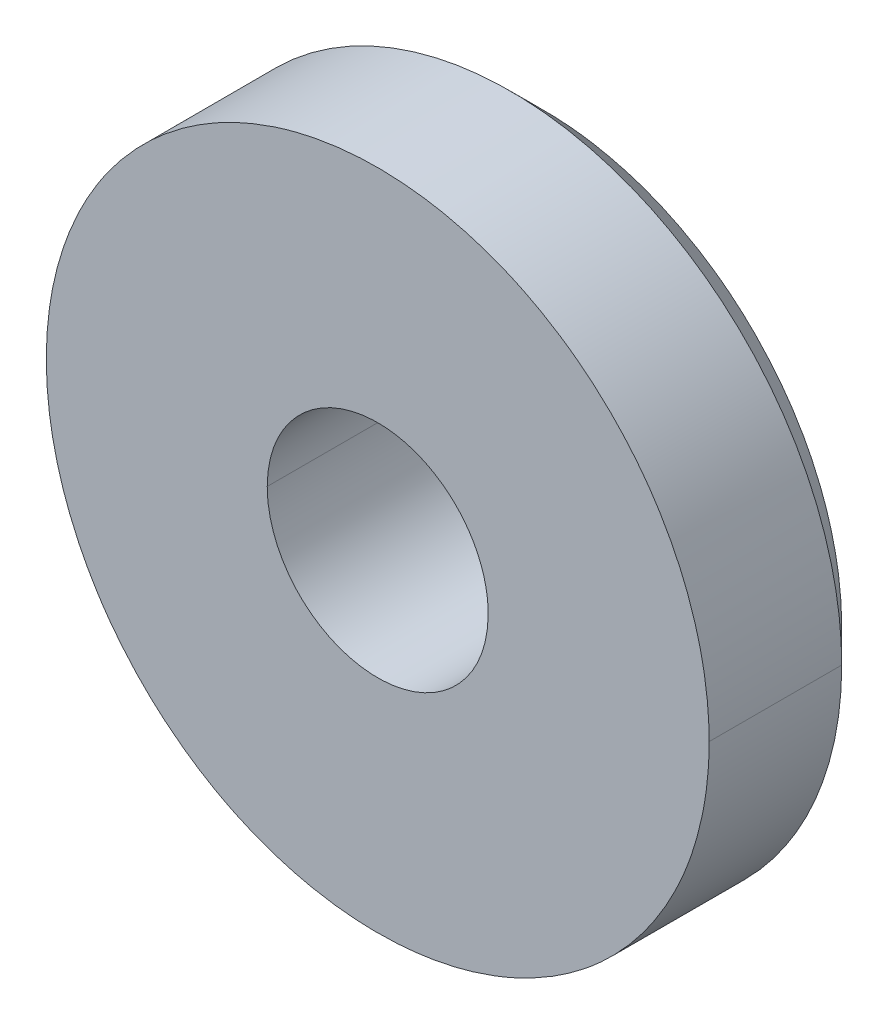
ISO-10303-21;
HEADER;
FILE_DESCRIPTION(('STEP AP214'),'2;1');
FILE_NAME('part.step','',(''),(''),'','','');
FILE_SCHEMA(('AUTOMOTIVE_DESIGN { 1 0 10303 214 1 1 1 1 }'));
ENDSEC;
DATA;
#1=APPLICATION_CONTEXT('core data for automotive mechanical design processes');
#2=APPLICATION_PROTOCOL_DEFINITION('international standard','automotive_design',2000,#1);
#3=PRODUCT_CONTEXT('',#1,'mechanical');
#4=PRODUCT('Part','Part','',(#3));
#5=PRODUCT_RELATED_PRODUCT_CATEGORY('part','',(#4));
#6=PRODUCT_DEFINITION_FORMATION('','',#4);
#7=PRODUCT_DEFINITION_CONTEXT('part definition',#1,'design');
#8=PRODUCT_DEFINITION('design','',#6,#7);
#9=PRODUCT_DEFINITION_SHAPE('','',#8);
#10=(LENGTH_UNIT() NAMED_UNIT(*) SI_UNIT(.MILLI.,.METRE.));
#11=(NAMED_UNIT(*) PLANE_ANGLE_UNIT() SI_UNIT($,.RADIAN.));
#12=(NAMED_UNIT(*) SI_UNIT($,.STERADIAN.) SOLID_ANGLE_UNIT());
#13=UNCERTAINTY_MEASURE_WITH_UNIT(LENGTH_MEASURE(1.E-05),#10,'distance_accuracy_value','');
#14=(GEOMETRIC_REPRESENTATION_CONTEXT(3) GLOBAL_UNCERTAINTY_ASSIGNED_CONTEXT((#13)) GLOBAL_UNIT_ASSIGNED_CONTEXT((#10,
#11,#12)) REPRESENTATION_CONTEXT('',''));
#15=CARTESIAN_POINT('',(0.,0.,0.));
#16=DIRECTION('',(0.,0.,1.));
#17=DIRECTION('',(1.,0.,0.));
#18=AXIS2_PLACEMENT_3D('',#15,#16,#17);
#19=CARTESIAN_POINT('',(-1.5946900874,-6.2154791283,3.85520000018));
#20=CARTESIAN_POINT('',(-1.5946900874,-6.2154791283,4.148));
#21=CARTESIAN_POINT('',(-1.5946900874,-5.98551454605,3.85520000018));
#22=CARTESIAN_POINT('',(-1.5946900874,-5.98551454605,4.148));
#23=CARTESIAN_POINT('',(-1.68473707036,-5.75533540536,3.85520000018));
#24=CARTESIAN_POINT('',(-1.68473707036,-5.75533540536,4.148));
#25=CARTESIAN_POINT('',(-1.86676092292,-5.57352611126,3.85520000018));
#26=CARTESIAN_POINT('',(-1.86676092292,-5.57352611126,4.148));
#27=CARTESIAN_POINT('',(-2.3266900874,-5.39343214534,3.85520000018));
#28=CARTESIAN_POINT('',(-2.3266900874,-5.39343214534,4.148));
#29=CARTESIAN_POINT('',(-2.78661925189,-5.57352611126,3.85520000018));
#30=CARTESIAN_POINT('',(-2.78661925189,-5.57352611126,4.148));
#31=CARTESIAN_POINT('',(-2.96864310444,-5.75533540536,3.85520000018));
#32=CARTESIAN_POINT('',(-2.96864310444,-5.75533540536,4.148));
#33=CARTESIAN_POINT('',(-3.0586900874,-5.98551454605,3.85520000018));
#34=CARTESIAN_POINT('',(-3.0586900874,-5.98551454605,4.148));
#35=CARTESIAN_POINT('',(-3.0586900874,-6.2154791283,3.85520000018));
#36=CARTESIAN_POINT('',(-3.0586900874,-6.2154791283,4.148));
#37=B_SPLINE_SURFACE_WITH_KNOTS('',5,1,((#19,#20),(#21,#22),(#23,#24),(#25,#26),(#27,#28),(#29,
#30),(#31,#32),(#33,#34),(#35,#36)),.UNSPECIFIED.,.F.,.F.,.F.,(6,3,6),(2,2),(0.,4.71238898038,
9.42477796077),(0.300000000745,1.5),.UNSPECIFIED.);
#38=DIRECTION('',(0.,0.,1.));
#39=VECTOR('',#38,1.);
#40=CARTESIAN_POINT('',(-3.0586900874,-6.2154791283,4.00160000009));
#41=LINE('',#40,#39);
#42=CARTESIAN_POINT('',(-3.0586900874,-6.2154791283,3.855200000045));
#43=VERTEX_POINT('',#42);
#44=CARTESIAN_POINT('',(-3.0586900874,-6.2154791283,4.148));
#45=VERTEX_POINT('',#44);
#46=EDGE_CURVE('E76',#43,#45,#41,.T.);
#47=CARTESIAN_POINT('',(-3.0586900874,-6.2154791283,4.148));
#48=CARTESIAN_POINT('',(-3.0587297130482,-6.17428402824898,4.148));
#49=CARTESIAN_POINT('',(-3.05522469420443,-6.13309724122196,4.148));
#50=CARTESIAN_POINT('',(-3.04137697436363,-6.05192396198568,4.148));
#51=CARTESIAN_POINT('',(-3.03104002627669,-6.01193648946896,4.148));
#52=CARTESIAN_POINT('',(-3.00378288511302,-5.93428259626322,4.148));
#53=CARTESIAN_POINT('',(-2.98686442898609,-5.89661556621344,4.148));
#54=CARTESIAN_POINT('',(-2.94695185028575,-5.82466314072065,4.148));
#55=CARTESIAN_POINT('',(-2.92395896373443,-5.79037705927075,4.148));
#56=CARTESIAN_POINT('',(-2.87254543566545,-5.72613212158392,4.148));
#57=CARTESIAN_POINT('',(-2.84412306936096,-5.69617464574419,4.148));
#58=CARTESIAN_POINT('',(-2.7826607481463,-5.64144521526489,4.148));
#59=CARTESIAN_POINT('',(-2.74962087442223,-5.61667316947299,4.148));
#60=CARTESIAN_POINT('',(-2.67977354823956,-5.57297011727616,4.148));
#61=CARTESIAN_POINT('',(-2.64295731047137,-5.55405316214536,4.148));
#62=CARTESIAN_POINT('',(-2.56669403809196,-5.52270871771052,4.148));
#63=CARTESIAN_POINT('',(-2.52725011221892,-5.51027370834599,4.148));
#64=CARTESIAN_POINT('',(-2.46030328340995,-5.49523878720352,4.148));
#65=CARTESIAN_POINT('',(-2.43321122260478,-5.49074126558087,4.148));
#66=CARTESIAN_POINT('',(-2.37869259937164,-5.48481005492516,4.148));
#67=CARTESIAN_POINT('',(-2.35126601793214,-5.48337654085006,4.148));
#68=CARTESIAN_POINT('',(-2.28270445413778,-5.48364682688609,4.148));
#69=CARTESIAN_POINT('',(-2.24156214459007,-5.48727440267562,4.148));
#70=CARTESIAN_POINT('',(-2.16044512212728,-5.50140051603713,4.148));
#71=CARTESIAN_POINT('',(-2.12047161014731,-5.5119058780797,4.148));
#72=CARTESIAN_POINT('',(-2.0429402455239,-5.53946418913209,4.148));
#73=CARTESIAN_POINT('',(-2.00537753931025,-5.55650346802521,4.148));
#74=CARTESIAN_POINT('',(-1.9335798662705,-5.59667217110095,4.148));
#75=CARTESIAN_POINT('',(-1.8993507259189,-5.61981200533305,4.148));
#76=CARTESIAN_POINT('',(-1.8352402249155,-5.67151574247714,4.148));
#77=CARTESIAN_POINT('',(-1.80536109566033,-5.70008241196175,4.148));
#78=CARTESIAN_POINT('',(-1.75086372717047,-5.7617708549217,4.148));
#79=CARTESIAN_POINT('',(-1.72623662010871,-5.79488479254579,4.148));
#80=CARTESIAN_POINT('',(-1.68282510812822,-5.8648637365777,4.148));
#81=CARTESIAN_POINT('',(-1.66405651560286,-5.90173854429671,4.148));
#82=CARTESIAN_POINT('',(-1.63300509841237,-5.97811720642323,4.148));
#83=CARTESIAN_POINT('',(-1.62071873375407,-6.0176196125785,4.148));
#84=CARTESIAN_POINT('',(-1.60614018691681,-6.08373114698219,4.148));
#85=CARTESIAN_POINT('',(-1.6018465809029,-6.10991628519223,4.148));
#86=CARTESIAN_POINT('',(-1.59612186005267,-6.16255718674684,4.148));
#87=CARTESIAN_POINT('',(-1.59468638557008,-6.18901247595829,4.148));
#88=CARTESIAN_POINT('',(-1.5946900874,-6.21547912811599,4.148));
#89=B_SPLINE_CURVE_WITH_KNOTS('',3,(#47,#48,#49,#50,#51,#52,#53,#54,#55,#56,#57,#58,#59,#60,#61,
#62,#63,#64,#65,#66,#67,#68,#69,#70,#71,#72,#73,#74,#75,#76,#77,#78,#79,#80,#81,#82,#83,#84,#85,
#86,#87,#88),.UNSPECIFIED.,.F.,.F.,(4,2,2,2,2,2,2,2,2,2,2,2,2,2,2,2,2,2,2,2,4),(0.,
0.123423883470309,0.246743968529999,0.370031529791894,0.493294023858346,0.616595740124948,
0.739895288744415,0.863488482338461,0.98693796776263,1.06916443342276,1.15139559417269,
1.27468367457197,1.39809427312452,1.5212480711825,1.64461339584236,1.76804178110369,
1.89126008296987,2.01480813698249,2.13828865045665,2.21774840992787,2.29708687244575),.UNSPECIFIED.);
#90=CARTESIAN_POINT('',(-1.5946900874,-6.215479128208,4.148));
#91=VERTEX_POINT('',#90);
#92=EDGE_CURVE('E24',#45,#91,#89,.T.);
#93=DIRECTION('',(0.,0.,-1.));
#94=VECTOR('',#93,1.);
#95=CARTESIAN_POINT('',(-1.5946900874,-6.2154791283,4.00160000009));
#96=LINE('',#95,#94);
#97=CARTESIAN_POINT('',(-1.5946900874,-6.2154791283,3.855200000045));
#98=VERTEX_POINT('',#97);
#99=EDGE_CURVE('E66',#91,#98,#96,.T.);
#100=CARTESIAN_POINT('',(-1.5946900874,-6.2154791283,3.8552));
#101=CARTESIAN_POINT('',(-1.5946900874,-5.98551454605,3.8552));
#102=CARTESIAN_POINT('',(-1.68473707036,-5.75533540536,3.8552));
#103=CARTESIAN_POINT('',(-1.86676092292,-5.57352611126,3.8552));
#104=CARTESIAN_POINT('',(-2.3266900874,-5.39343214534,3.8552));
#105=CARTESIAN_POINT('',(-2.78661925189,-5.57352611126,3.8552));
#106=CARTESIAN_POINT('',(-2.96864310444,-5.75533540536,3.8552));
#107=CARTESIAN_POINT('',(-3.0586900874,-5.98551454605,3.8552));
#108=CARTESIAN_POINT('',(-3.0586900874,-6.2154791283,3.8552));
#109=B_SPLINE_CURVE_WITH_KNOTS('',5,(#100,#101,#102,#103,#104,#105,#106,#107,#108),
.UNSPECIFIED.,.F.,.F.,(6,3,6),(0.,157.079632679,314.159265359),.UNSPECIFIED.);
#110=EDGE_CURVE('E75',#43,#98,#109,.F.);
#111=ORIENTED_EDGE('',*,*,#46,.T.);
#112=ORIENTED_EDGE('',*,*,#92,.T.);
#113=ORIENTED_EDGE('',*,*,#99,.T.);
#114=ORIENTED_EDGE('',*,*,#110,.F.);
#115=EDGE_LOOP('',(#111,#112,#113,#114));
#116=FACE_BOUND('',#115,.T.);
#117=ADVANCED_FACE('F17',(#116),#37,.T.);
#118=CARTESIAN_POINT('',(-1.6678900874,-6.2154791283,3.782));
#119=CARTESIAN_POINT('',(-1.5946900874,-6.2154791283,3.8552));
#120=CARTESIAN_POINT('',(-1.6678900874,-6.00851100428,3.782));
#121=CARTESIAN_POINT('',(-1.5946900874,-5.98551454605,3.8552));
#122=CARTESIAN_POINT('',(-1.74893237207,-5.80134977765,3.782));
#123=CARTESIAN_POINT('',(-1.68473707036,-5.75533540536,3.8552));
#124=CARTESIAN_POINT('',(-1.91275383936,-5.63772141296,3.782));
#125=CARTESIAN_POINT('',(-1.86676092292,-5.57352611126,3.8552));
#126=CARTESIAN_POINT('',(-2.3266900874,-5.47563684363,3.782));
#127=CARTESIAN_POINT('',(-2.3266900874,-5.39343214534,3.8552));
#128=CARTESIAN_POINT('',(-2.74062633544,-5.63772141296,3.782));
#129=CARTESIAN_POINT('',(-2.78661925189,-5.57352611126,3.8552));
#130=CARTESIAN_POINT('',(-2.90444780274,-5.80134977765,3.782));
#131=CARTESIAN_POINT('',(-2.96864310444,-5.75533540536,3.8552));
#132=CARTESIAN_POINT('',(-2.9854900874,-6.00851100428,3.782));
#133=CARTESIAN_POINT('',(-3.0586900874,-5.98551454605,3.8552));
#134=CARTESIAN_POINT('',(-2.9854900874,-6.2154791283,3.782));
#135=CARTESIAN_POINT('',(-3.0586900874,-6.2154791283,3.8552));
#136=B_SPLINE_SURFACE_WITH_KNOTS('',5,1,((#118,#119),(#120,#121),(#122,#123),(#124,#125),(#126,
#127),(#128,#129),(#130,#131),(#132,#133),(#134,#135)),.UNSPECIFIED.,.F.,.F.,.F.,(6,3,6),(2,2),
(0.,157.079632679,314.159265359),(-0.212132034356,0.212132034356),.UNSPECIFIED.);
#137=DIRECTION('',(0.707106781186548,0.,0.707106781186548));
#138=VECTOR('',#137,1.);
#139=CARTESIAN_POINT('',(-1.6312900874,-6.2154791283,3.8186));
#140=LINE('',#139,#138);
#141=CARTESIAN_POINT('',(-1.6678900874,-6.2154791283,3.782));
#142=VERTEX_POINT('',#141);
#143=EDGE_CURVE('E238',#142,#98,#140,.T.);
#144=CARTESIAN_POINT('',(-1.6678900874,-6.2154791283,3.782));
#145=CARTESIAN_POINT('',(-1.66785439953469,-6.17839165312669,3.782));
#146=CARTESIAN_POINT('',(-1.67101094459766,-6.14131171881073,3.782));
#147=CARTESIAN_POINT('',(-1.68348179010922,-6.06823330002169,3.782));
#148=CARTESIAN_POINT('',(-1.69279088073047,-6.03223392749363,3.782));
#149=CARTESIAN_POINT('',(-1.71734726974411,-5.96229834452599,3.782));
#150=CARTESIAN_POINT('',(-1.73259769562315,-5.92836323159651,3.782));
#151=CARTESIAN_POINT('',(-1.76857865398284,-5.86354340880975,3.782));
#152=CARTESIAN_POINT('',(-1.78930831263721,-5.83265821363046,3.782));
#153=CARTESIAN_POINT('',(-1.83563463124926,-5.77482805343801,3.782));
#154=CARTESIAN_POINT('',(-1.86122706279385,-5.74787970089898,3.782));
#155=CARTESIAN_POINT('',(-1.91656648928812,-5.6986497607574,3.782));
#156=CARTESIAN_POINT('',(-1.94631372800095,-5.67636844716259,3.782));
#157=CARTESIAN_POINT('',(-2.00918165227777,-5.63707618468034,3.782));
#158=CARTESIAN_POINT('',(-2.04230830399111,-5.62007477879474,3.782));
#159=CARTESIAN_POINT('',(-2.1109490499255,-5.59189260314835,3.782));
#160=CARTESIAN_POINT('',(-2.14646295197539,-5.58071136550214,3.782));
#161=CARTESIAN_POINT('',(-2.21877624128473,-5.56451278652949,3.782));
#162=CARTESIAN_POINT('',(-2.2555722314737,-5.5594802666227,3.782));
#163=CARTESIAN_POINT('',(-2.3294852744353,-5.55564652709677,3.782));
#164=CARTESIAN_POINT('',(-2.36660231388724,-5.55684505017121,3.782));
#165=CARTESIAN_POINT('',(-2.44016666175033,-5.56545733158197,3.782));
#166=CARTESIAN_POINT('',(-2.47661286933997,-5.5728805110866,3.782));
#167=CARTESIAN_POINT('',(-2.54773421917535,-5.59375527720736,3.782));
#168=CARTESIAN_POINT('',(-2.58240943987537,-5.60720659651995,3.782));
#169=CARTESIAN_POINT('',(-2.6489444182169,-5.63971494731152,3.782));
#170=CARTESIAN_POINT('',(-2.68080920883659,-5.65876168201099,3.782));
#171=CARTESIAN_POINT('',(-2.74089917327645,-5.70192189620624,3.782));
#172=CARTESIAN_POINT('',(-2.76912432942233,-5.72603540030508,3.782));
#173=CARTESIAN_POINT('',(-2.82120211999593,-5.77870654759098,3.782));
#174=CARTESIAN_POINT('',(-2.84504447854648,-5.80727435187043,3.782));
#175=CARTESIAN_POINT('',(-2.88759408400689,-5.86800768920819,3.782));
#176=CARTESIAN_POINT('',(-2.90630144776454,-5.90017314037792,3.782));
#177=CARTESIAN_POINT('',(-2.93805227174925,-5.96721278434888,3.782));
#178=CARTESIAN_POINT('',(-2.95109189643547,-6.0020887927142,3.782));
#179=CARTESIAN_POINT('',(-2.97108784512073,-6.07349522130386,3.782));
#180=CARTESIAN_POINT('',(-2.9780533982873,-6.11002304255177,3.782));
#181=CARTESIAN_POINT('',(-2.98430196070536,-6.16965663838581,3.782));
#182=CARTESIAN_POINT('',(-2.98550080822271,-6.19257430920654,3.782));
#183=CARTESIAN_POINT('',(-2.9854900874,-6.2154791283,3.782));
#184=B_SPLINE_CURVE_WITH_KNOTS('',3,(#144,#145,#146,#147,#148,#149,#150,#151,#152,#153,#154,
#155,#156,#157,#158,#159,#160,#161,#162,#163,#164,#165,#166,#167,#168,#169,#170,#171,#172,#173,
#174,#175,#176,#177,#178,#179,#180,#181,#182,#183),.UNSPECIFIED.,.F.,.F.,(4,2,2,2,2,2,2,2,2,2,2,
2,2,2,2,2,2,2,2,4),(0.,0.111116908842464,0.222139846908256,0.333221305983547,0.444285060501159,
0.555252678124525,0.666226808971294,0.777400364592113,0.888564981550005,0.999454622056889,
1.1103396834925,1.22139287571059,1.33244114402583,1.44328632599083,1.55413204620681,
1.66523442901891,1.7763342834655,1.88750920613075,1.99851490971071,2.0672313803994),.UNSPECIFIED.);
#185=CARTESIAN_POINT('',(-2.9854900874,-6.2154791283,3.782));
#186=VERTEX_POINT('',#185);
#187=EDGE_CURVE('E154',#142,#186,#184,.T.);
#188=DIRECTION('',(0.707106781186548,0.,-0.707106781186548));
#189=VECTOR('',#188,1.);
#190=CARTESIAN_POINT('',(-3.0220900874,-6.2154791283,3.8186));
#191=LINE('',#190,#189);
#192=EDGE_CURVE('E236',#43,#186,#191,.T.);
#193=ORIENTED_EDGE('',*,*,#143,.F.);
#194=ORIENTED_EDGE('',*,*,#187,.T.);
#195=ORIENTED_EDGE('',*,*,#192,.F.);
#196=ORIENTED_EDGE('',*,*,#110,.T.);
#197=EDGE_LOOP('',(#193,#194,#195,#196));
#198=FACE_BOUND('',#197,.T.);
#199=ADVANCED_FACE('F163',(#198),#136,.T.);
#200=CARTESIAN_POINT('',(-2.9854900874,-6.2154791283,3.782));
#201=CARTESIAN_POINT('',(-3.0586900874,-6.2154791283,3.8552));
#202=CARTESIAN_POINT('',(-2.9854900874,-6.42244725232,3.782));
#203=CARTESIAN_POINT('',(-3.0586900874,-6.44544371054,3.8552));
#204=CARTESIAN_POINT('',(-2.90444780274,-6.62960847894,3.782));
#205=CARTESIAN_POINT('',(-2.96864310444,-6.67562285124,3.8552));
#206=CARTESIAN_POINT('',(-2.74062633544,-6.79323684363,3.782));
#207=CARTESIAN_POINT('',(-2.78661925189,-6.85743214534,3.8552));
#208=CARTESIAN_POINT('',(-2.3266900874,-6.95532141296,3.782));
#209=CARTESIAN_POINT('',(-2.3266900874,-7.03752611126,3.8552));
#210=CARTESIAN_POINT('',(-1.91275383936,-6.79323684363,3.782));
#211=CARTESIAN_POINT('',(-1.86676092292,-6.85743214534,3.8552));
#212=CARTESIAN_POINT('',(-1.74893237207,-6.62960847894,3.782));
#213=CARTESIAN_POINT('',(-1.68473707036,-6.67562285124,3.8552));
#214=CARTESIAN_POINT('',(-1.6678900874,-6.42244725232,3.782));
#215=CARTESIAN_POINT('',(-1.5946900874,-6.44544371054,3.8552));
#216=CARTESIAN_POINT('',(-1.6678900874,-6.2154791283,3.782));
#217=CARTESIAN_POINT('',(-1.5946900874,-6.2154791283,3.8552));
#218=B_SPLINE_SURFACE_WITH_KNOTS('',5,1,((#200,#201),(#202,#203),(#204,#205),(#206,#207),(#208,
#209),(#210,#211),(#212,#213),(#214,#215),(#216,#217)),.UNSPECIFIED.,.F.,.F.,.F.,(6,3,6),(2,2),
(314.159265359,471.238898038,628.318530718),(-0.212132034358,0.212132034358),.UNSPECIFIED.);
#219=CARTESIAN_POINT('',(-2.9854900874,-6.2154791283,3.782));
#220=CARTESIAN_POINT('',(-2.98552577526541,-6.25256660347505,3.782));
#221=CARTESIAN_POINT('',(-2.98236923020243,-6.28964653779285,3.782));
#222=CARTESIAN_POINT('',(-2.9698983846902,-6.36272495658544,3.782));
#223=CARTESIAN_POINT('',(-2.96058929406828,-6.39872432911521,3.782));
#224=CARTESIAN_POINT('',(-2.93603290505224,-6.46865991208596,3.782));
#225=CARTESIAN_POINT('',(-2.92078247917143,-6.50259502501684,3.782));
#226=CARTESIAN_POINT('',(-2.88480152080738,-6.56741484780559,3.782));
#227=CARTESIAN_POINT('',(-2.8640718621504,-6.59830004298548,3.782));
#228=CARTESIAN_POINT('',(-2.81774554353548,-6.65613020317486,3.782));
#229=CARTESIAN_POINT('',(-2.79215311199118,-6.68307855571068,3.782));
#230=CARTESIAN_POINT('',(-2.73681368549832,-6.7323084958463,3.782));
#231=CARTESIAN_POINT('',(-2.70706644678659,-6.75458980943838,3.782));
#232=CARTESIAN_POINT('',(-2.64419852251058,-6.79388207191725,3.782));
#233=CARTESIAN_POINT('',(-2.6110718707967,-6.81088347780186,3.782));
#234=CARTESIAN_POINT('',(-2.54243112486149,-6.83906565344641,3.782));
#235=CARTESIAN_POINT('',(-2.50691722281131,-6.85024689109176,3.782));
#236=CARTESIAN_POINT('',(-2.43460393350043,-6.86644547006304,3.782));
#237=CARTESIAN_POINT('',(-2.39780794331015,-6.87147798996912,3.782));
#238=CARTESIAN_POINT('',(-2.32389490034609,-6.87531172949322,3.782));
#239=CARTESIAN_POINT('',(-2.286777860893,-6.87411320641766,3.782));
#240=CARTESIAN_POINT('',(-2.21321351302882,-6.8655009250044,3.782));
#241=CARTESIAN_POINT('',(-2.17676730543924,-6.85807774549854,3.782));
#242=CARTESIAN_POINT('',(-2.10564595560421,-6.83720297937526,3.782));
#243=CARTESIAN_POINT('',(-2.0709707349045,-6.82375166006139,3.782));
#244=CARTESIAN_POINT('',(-2.00443575656426,-6.79124330926746,3.782));
#245=CARTESIAN_POINT('',(-1.97257096594554,-6.77219657456699,3.782));
#246=CARTESIAN_POINT('',(-1.9124810015077,-6.72903636036998,3.782));
#247=CARTESIAN_POINT('',(-1.88425584536288,-6.70492285627038,3.782));
#248=CARTESIAN_POINT('',(-1.83217805479108,-6.65225170898294,3.782));
#249=CARTESIAN_POINT('',(-1.80833569624131,-6.62368390470265,3.782));
#250=CARTESIAN_POINT('',(-1.76578609078249,-6.56295056736343,3.782));
#251=CARTESIAN_POINT('',(-1.74707872702564,-6.53078511619308,3.782));
#252=CARTESIAN_POINT('',(-1.71532790304227,-6.46374547222039,3.782));
#253=CARTESIAN_POINT('',(-1.70228827835668,-6.42886946385391,3.782));
#254=CARTESIAN_POINT('',(-1.68229232967321,-6.35746303526202,3.782));
#255=CARTESIAN_POINT('',(-1.67532677650777,-6.32093521401304,3.782));
#256=CARTESIAN_POINT('',(-1.66907821409353,-6.26130161818998,3.782));
#257=CARTESIAN_POINT('',(-1.66787936657731,-6.23838394738136,3.782));
#258=CARTESIAN_POINT('',(-1.6678900874,-6.2154791283,3.782));
#259=B_SPLINE_CURVE_WITH_KNOTS('',3,(#219,#220,#221,#222,#223,#224,#225,#226,#227,#228,#229,
#230,#231,#232,#233,#234,#235,#236,#237,#238,#239,#240,#241,#242,#243,#244,#245,#246,#247,#248,
#249,#250,#251,#252,#253,#254,#255,#256,#257,#258),.UNSPECIFIED.,.F.,.F.,(4,2,2,2,2,2,2,2,2,2,2,
2,2,2,2,2,2,2,2,4),(0.,0.11111690884781,0.222139846918973,0.333221306000066,0.44428506052337,
0.55525267813924,0.666226808978553,0.77740036459947,0.888564981557445,0.999454622067872,
1.11033968350701,1.22139287572566,1.33244114404143,1.4432863260055,1.55413204622057,
1.66523442903309,1.77633428348011,1.88750920614792,1.99851490973026,2.06723138038268),.UNSPECIFIED.);
#260=EDGE_CURVE('E159',#186,#142,#259,.T.);
#261=CARTESIAN_POINT('',(-3.0586900874,-6.2154791283,3.8552));
#262=CARTESIAN_POINT('',(-3.0586900874,-6.44544371054,3.8552));
#263=CARTESIAN_POINT('',(-2.96864310444,-6.67562285124,3.8552));
#264=CARTESIAN_POINT('',(-2.78661925189,-6.85743214534,3.8552));
#265=CARTESIAN_POINT('',(-2.3266900874,-7.03752611126,3.8552));
#266=CARTESIAN_POINT('',(-1.86676092292,-6.85743214534,3.8552));
#267=CARTESIAN_POINT('',(-1.68473707036,-6.67562285124,3.8552));
#268=CARTESIAN_POINT('',(-1.5946900874,-6.44544371054,3.8552));
#269=CARTESIAN_POINT('',(-1.5946900874,-6.2154791283,3.8552));
#270=B_SPLINE_CURVE_WITH_KNOTS('',5,(#261,#262,#263,#264,#265,#266,#267,#268,#269),
.UNSPECIFIED.,.F.,.F.,(6,3,6),(9.42477796077,14.1371669412,18.8495559215),.UNSPECIFIED.);
#271=EDGE_CURVE('E153',#43,#98,#270,.T.);
#272=ORIENTED_EDGE('',*,*,#192,.T.);
#273=ORIENTED_EDGE('',*,*,#260,.T.);
#274=ORIENTED_EDGE('',*,*,#143,.T.);
#275=ORIENTED_EDGE('',*,*,#271,.F.);
#276=EDGE_LOOP('',(#272,#273,#274,#275));
#277=FACE_BOUND('',#276,.T.);
#278=ADVANCED_FACE('F126',(#277),#218,.T.);
#279=CARTESIAN_POINT('',(-2.3266900874,-6.2154791283,3.782));
#280=DIRECTION('',(0.,0.,1.));
#281=DIRECTION('',(1.,0.,0.));
#282=AXIS2_PLACEMENT_3D('',#279,#280,#281);
#283=PLANE('',#282);
#284=CARTESIAN_POINT('',(-2.5706900874,-6.2154791283,3.782));
#285=CARTESIAN_POINT('',(-2.5707021077229,-6.22919817813619,3.782));
#286=CARTESIAN_POINT('',(-2.56953662919008,-6.24291343735224,3.782));
#287=CARTESIAN_POINT('',(-2.56493080478152,-6.26994494809956,3.782));
#288=CARTESIAN_POINT('',(-2.56149238093263,-6.28326152682293,3.782));
#289=CARTESIAN_POINT('',(-2.55241817304435,-6.30913548549327,3.782));
#290=CARTESIAN_POINT('',(-2.54678123798789,-6.32169246377178,3.782));
#291=CARTESIAN_POINT('',(-2.53349571536123,-6.34567279795699,3.782));
#292=CARTESIAN_POINT('',(-2.52584743856073,-6.35709632861593,3.782));
#293=CARTESIAN_POINT('',(-2.50016966971488,-6.38917907396062,3.782));
#294=CARTESIAN_POINT('',(-2.47937704674538,-6.40773442523661,3.782));
#295=CARTESIAN_POINT('',(-2.43281991018911,-6.43690452787082,3.782));
#296=CARTESIAN_POINT('',(-2.40704669952372,-6.44750522838668,3.782));
#297=CARTESIAN_POINT('',(-2.35350135742393,-6.45955000682394,3.782));
#298=CARTESIAN_POINT('',(-2.32573438058671,-6.46101689384326,3.782));
#299=CARTESIAN_POINT('',(-2.27123832102816,-6.45467575430878,3.782));
#300=CARTESIAN_POINT('',(-2.24451078594693,-6.44685440623658,3.782));
#301=CARTESIAN_POINT('',(-2.19520928728014,-6.42283320017857,3.782));
#302=CARTESIAN_POINT('',(-2.17262788340661,-6.40664855340529,3.782));
#303=CARTESIAN_POINT('',(-2.13401238813075,-6.36763295796564,3.782));
#304=CARTESIAN_POINT('',(-2.11799334843978,-6.34478693348896,3.782));
#305=CARTESIAN_POINT('',(-2.10032739180873,-6.30761560926725,3.782));
#306=CARTESIAN_POINT('',(-2.09549575095424,-6.29471115934186,3.782));
#307=CARTESIAN_POINT('',(-2.08807367911316,-6.26827708572856,3.782));
#308=CARTESIAN_POINT('',(-2.08547986832616,-6.25474843744227,3.782));
#309=CARTESIAN_POINT('',(-2.08313668454035,-6.23259128521639,3.782));
#310=CARTESIAN_POINT('',(-2.0826846743972,-6.22403195798279,3.782));
#311=CARTESIAN_POINT('',(-2.0826900874,-6.2154791283,3.782));
#312=B_SPLINE_CURVE_WITH_KNOTS('',3,(#284,#285,#286,#287,#288,#289,#290,#291,#292,#293,#294,
#295,#296,#297,#298,#299,#300,#301,#302,#303,#304,#305,#306,#307,#308,#309,#310,#311),
.UNSPECIFIED.,.F.,.F.,(4,2,2,2,2,2,2,2,2,2,2,2,2,4),(0.,0.0411014434340057,0.0821681754324497,
0.123256436590269,0.164338352982463,0.246247380885569,0.328300751909617,0.410149135558562,
0.492115050995874,0.573932408388981,0.655936388731492,0.697112382822887,0.738226079293487,
0.763888788658428),.UNSPECIFIED.);
#313=CARTESIAN_POINT('',(-2.5706900874,-6.2154791283,3.782));
#314=VERTEX_POINT('',#313);
#315=CARTESIAN_POINT('',(-2.0826900874,-6.2154791283,3.782));
#316=VERTEX_POINT('',#315);
#317=EDGE_CURVE('E115',#314,#316,#312,.T.);
#318=ORIENTED_EDGE('',*,*,#317,.T.);
#319=CARTESIAN_POINT('',(-2.0826900874,-6.2154791283,3.782));
#320=CARTESIAN_POINT('',(-2.08267694111645,-6.20176084205352,3.782));
#321=CARTESIAN_POINT('',(-2.08384296827406,-6.18804532946043,3.782));
#322=CARTESIAN_POINT('',(-2.08844988939444,-6.16101313673476,3.782));
#323=CARTESIAN_POINT('',(-2.09188888968551,-6.14769613423882,3.782));
#324=CARTESIAN_POINT('',(-2.10096098764265,-6.1218231322955,3.782));
#325=CARTESIAN_POINT('',(-2.10659527435899,-6.10926754952819,3.782));
#326=CARTESIAN_POINT('',(-2.11988877152269,-6.08528252901385,3.782));
#327=CARTESIAN_POINT('',(-2.127547570369,-6.07385286300571,3.782));
#328=CARTESIAN_POINT('',(-2.14467578770429,-6.05243329763231,3.782));
#329=CARTESIAN_POINT('',(-2.15414603100901,-6.04244405779295,3.782));
#330=CARTESIAN_POINT('',(-2.1746259257622,-6.0241930806855,3.782));
#331=CARTESIAN_POINT('',(-2.18563560797713,-6.01593137795137,3.782));
#332=CARTESIAN_POINT('',(-2.20891450621805,-6.00135451166845,3.782));
#333=CARTESIAN_POINT('',(-2.22118666160575,-5.99504403431803,3.782));
#334=CARTESIAN_POINT('',(-2.24659758522142,-5.98458625888299,3.782));
#335=CARTESIAN_POINT('',(-2.25973529974465,-5.98043638342616,3.782));
#336=CARTESIAN_POINT('',(-2.29069080075316,-5.97347762606543,3.782));
#337=CARTESIAN_POINT('',(-2.30869906791842,-5.97148077429357,3.782));
#338=CARTESIAN_POINT('',(-2.3404016643382,-5.97147787382268,3.782));
#339=CARTESIAN_POINT('',(-2.3541032229762,-5.97263553267166,3.782));
#340=CARTESIAN_POINT('',(-2.38112682523739,-5.97722750259558,3.782));
#341=CARTESIAN_POINT('',(-2.39444846516928,-5.9806641476588,3.782));
#342=CARTESIAN_POINT('',(-2.43321725973362,-5.99427713062706,3.782));
#343=CARTESIAN_POINT('',(-2.45758486794942,-6.00775737220162,3.782));
#344=CARTESIAN_POINT('',(-2.50047412262921,-6.04205176351261,3.782));
#345=CARTESIAN_POINT('',(-2.5189927088417,-6.06286974039388,3.782));
#346=CARTESIAN_POINT('',(-2.54083177210876,-6.0977188028153,3.782));
#347=CARTESIAN_POINT('',(-2.54713052309718,-6.10997672592991,3.782));
#348=CARTESIAN_POINT('',(-2.55758144933437,-6.13538753554114,3.782));
#349=CARTESIAN_POINT('',(-2.56173473325166,-6.14853995582248,3.782));
#350=CARTESIAN_POINT('',(-2.56672530583682,-6.17072423545924,3.782));
#351=CARTESIAN_POINT('',(-2.56821187309918,-6.17961652535467,3.782));
#352=CARTESIAN_POINT('',(-2.57019398654303,-6.19749755500132,3.782));
#353=CARTESIAN_POINT('',(-2.57069099907835,-6.20648613216829,3.782));
#354=CARTESIAN_POINT('',(-2.5706900874,-6.2154791283,3.782));
#355=B_SPLINE_CURVE_WITH_KNOTS('',3,(#319,#320,#321,#322,#323,#324,#325,#326,#327,#328,#329,
#330,#331,#332,#333,#334,#335,#336,#337,#338,#339,#340,#341,#342,#343,#344,#345,#346,#347,#348,
#349,#350,#351,#352,#353,#354),.UNSPECIFIED.,.F.,.F.,(4,2,2,2,2,2,2,2,2,2,2,2,2,2,2,2,2,4),(0.,
0.0411011873926098,0.0821681754317654,0.123257437897714,0.164338352972977,0.205438018386299,
0.246538505315008,0.287736948773902,0.328886133539551,0.382765464936075,0.423828763132068,
0.464934180747948,0.546812467487794,0.628733522858245,0.669916143548082,0.711077461806767,
0.73807396306989,0.765030430191952),.UNSPECIFIED.);
#356=EDGE_CURVE('E147',#316,#314,#355,.T.);
#357=ORIENTED_EDGE('',*,*,#356,.T.);
#358=EDGE_LOOP('',(#318,#357));
#359=FACE_BOUND('',#358,.T.);
#360=ORIENTED_EDGE('',*,*,#260,.F.);
#361=ORIENTED_EDGE('',*,*,#187,.F.);
#362=EDGE_LOOP('',(#360,#361));
#363=FACE_BOUND('',#362,.T.);
#364=ADVANCED_FACE('F105',(#359,#363),#283,.F.);
#365=CARTESIAN_POINT('',(-3.0586900874,-6.2154791283,3.8552));
#366=CARTESIAN_POINT('',(-3.0586900874,-6.2154791283,4.148));
#367=CARTESIAN_POINT('',(-3.0586900874,-6.44544371054,3.8552));
#368=CARTESIAN_POINT('',(-3.0586900874,-6.44544371054,4.148));
#369=CARTESIAN_POINT('',(-2.96864310444,-6.67562285124,3.8552));
#370=CARTESIAN_POINT('',(-2.96864310444,-6.67562285124,4.148));
#371=CARTESIAN_POINT('',(-2.78661925189,-6.85743214534,3.8552));
#372=CARTESIAN_POINT('',(-2.78661925189,-6.85743214534,4.148));
#373=CARTESIAN_POINT('',(-2.3266900874,-7.03752611126,3.8552));
#374=CARTESIAN_POINT('',(-2.3266900874,-7.03752611126,4.148));
#375=CARTESIAN_POINT('',(-1.86676092292,-6.85743214534,3.8552));
#376=CARTESIAN_POINT('',(-1.86676092292,-6.85743214534,4.148));
#377=CARTESIAN_POINT('',(-1.68473707036,-6.67562285124,3.8552));
#378=CARTESIAN_POINT('',(-1.68473707036,-6.67562285124,4.148));
#379=CARTESIAN_POINT('',(-1.5946900874,-6.44544371054,3.8552));
#380=CARTESIAN_POINT('',(-1.5946900874,-6.44544371054,4.148));
#381=CARTESIAN_POINT('',(-1.5946900874,-6.2154791283,3.8552));
#382=CARTESIAN_POINT('',(-1.5946900874,-6.2154791283,4.148));
#383=B_SPLINE_SURFACE_WITH_KNOTS('',5,1,((#365,#366),(#367,#368),(#369,#370),(#371,#372),(#373,
#374),(#375,#376),(#377,#378),(#379,#380),(#381,#382)),.UNSPECIFIED.,.F.,.F.,.F.,(6,3,6),(2,2),
(9.42477796077,14.1371669412,18.8495559215),(0.3,1.5),.UNSPECIFIED.);
#384=CARTESIAN_POINT('',(-3.0586900874,-6.2154791283,4.148));
#385=CARTESIAN_POINT('',(-3.0587297086451,-6.25667446832543,4.148));
#386=CARTESIAN_POINT('',(-3.05522465106414,-6.29786149566738,4.148));
#387=CARTESIAN_POINT('',(-3.04137685624324,-6.37903476201844,4.148));
#388=CARTESIAN_POINT('',(-3.03103995145345,-6.41902199489569,4.148));
#389=CARTESIAN_POINT('',(-3.00378320073869,-6.49667474653684,4.148));
#390=CARTESIAN_POINT('',(-2.98686520808974,-6.5343409154709,4.148));
#391=CARTESIAN_POINT('',(-2.946952953147,-6.60629349780654,4.148));
#392=CARTESIAN_POINT('',(-2.92395964125458,-6.64058043869167,4.148));
#393=CARTESIAN_POINT('',(-2.87254636432963,-6.70482488658193,4.148));
#394=CARTESIAN_POINT('',(-2.84412501318658,-6.73478128429405,4.148));
#395=CARTESIAN_POINT('',(-2.7826636132686,-6.78951108566605,4.148));
#396=CARTESIAN_POINT('',(-2.74962328568669,-6.81428417622973,4.148));
#397=CARTESIAN_POINT('',(-2.67979140664495,-6.85797636653197,4.148));
#398=CARTESIAN_POINT('',(-2.64299320878682,-6.87688484678352,4.148));
#399=CARTESIAN_POINT('',(-2.56674096539612,-6.90823573339161,4.148));
#400=CARTESIAN_POINT('',(-2.527287135362,-6.92067866369988,4.148));
#401=CARTESIAN_POINT('',(-2.44694768686028,-6.93871644563332,4.148));
#402=CARTESIAN_POINT('',(-2.40606584717556,-6.94432814261456,4.148));
#403=CARTESIAN_POINT('',(-2.3239420483316,-6.94862791764507,4.148));
#404=CARTESIAN_POINT('',(-2.28270010405803,-6.9473162805447,4.148));
#405=CARTESIAN_POINT('',(-2.20095721874431,-6.93778691228294,4.148));
#406=CARTESIAN_POINT('',(-2.16045749128119,-6.9295587509155,4.148));
#407=CARTESIAN_POINT('',(-2.08142261089967,-6.90640324072093,4.148));
#408=CARTESIAN_POINT('',(-2.04288737044273,-6.89147619069078,4.148));
#409=CARTESIAN_POINT('',(-1.96894205513095,-6.85539196716114,4.148));
#410=CARTESIAN_POINT('',(-1.933526401546,-6.83424622103803,4.148));
#411=CARTESIAN_POINT('',(-1.86673633895541,-6.78632291249865,4.148));
#412=CARTESIAN_POINT('',(-1.83536195128473,-6.75954532035226,4.148));
#413=CARTESIAN_POINT('',(-1.7774689164374,-6.70104981797776,4.148));
#414=CARTESIAN_POINT('',(-1.75096174136914,-6.66932055382634,4.148));
#415=CARTESIAN_POINT('',(-1.70365153313922,-6.60186154101796,4.148));
#416=CARTESIAN_POINT('',(-1.68284818188614,-6.56613201560455,4.148));
#417=CARTESIAN_POINT('',(-1.64753442959929,-6.49166426259355,4.148));
#418=CARTESIAN_POINT('',(-1.6330284261953,-6.45292395466247,4.148));
#419=CARTESIAN_POINT('',(-1.6107677206478,-6.3735838031502,4.148));
#420=CARTESIAN_POINT('',(-1.60300281034232,-6.3329868695843,4.148));
#421=CARTESIAN_POINT('',(-1.59736311474085,-6.27934781578896,4.148));
#422=CARTESIAN_POINT('',(-1.59635993440655,-6.26658333667723,4.148));
#423=CARTESIAN_POINT('',(-1.59502434814478,-6.24104065823106,4.148));
#424=CARTESIAN_POINT('',(-1.59469082597898,-6.22826251731059,4.148));
#425=CARTESIAN_POINT('',(-1.5946900874,-6.215479128116,4.148));
#426=B_SPLINE_CURVE_WITH_KNOTS('',3,(#384,#385,#386,#387,#388,#389,#390,#391,#392,#393,#394,
#395,#396,#397,#398,#399,#400,#401,#402,#403,#404,#405,#406,#407,#408,#409,#410,#411,#412,#413,
#414,#415,#416,#417,#418,#419,#420,#421,#422,#423,#424,#425),.UNSPECIFIED.,.F.,.F.,(4,2,2,2,2,2,
2,2,2,2,2,2,2,2,2,2,2,2,2,2,4),(0.,0.123424601040045,0.246743968523861,0.370028633603548,
0.493294023875086,0.616590933531938,0.739895288754697,0.863421634114165,0.986937967650874,
1.11014909727428,1.23335515759694,1.35674734822781,1.48013403562467,1.60329539144353,
1.72645739743885,1.84990607308133,1.97334786282475,2.09687571760217,2.22021618393042,
2.25861553582881,2.29695082738455),.UNSPECIFIED.);
#427=EDGE_CURVE('E72',#45,#91,#426,.T.);
#428=ORIENTED_EDGE('',*,*,#99,.F.);
#429=ORIENTED_EDGE('',*,*,#427,.F.);
#430=ORIENTED_EDGE('',*,*,#46,.F.);
#431=ORIENTED_EDGE('',*,*,#271,.T.);
#432=EDGE_LOOP('',(#428,#429,#430,#431));
#433=FACE_BOUND('',#432,.T.);
#434=ADVANCED_FACE('F78',(#433),#383,.T.);
#435=CARTESIAN_POINT('',(-2.0826900874,-6.2154791283,3.782));
#436=CARTESIAN_POINT('',(-2.0826900874,-6.2154791283,4.148));
#437=CARTESIAN_POINT('',(-2.0826900874,-6.13882426755,3.782));
#438=CARTESIAN_POINT('',(-2.0826900874,-6.13882426755,4.148));
#439=CARTESIAN_POINT('',(-2.11270574839,-6.06209788732,3.782));
#440=CARTESIAN_POINT('',(-2.11270574839,-6.06209788732,4.148));
#441=CARTESIAN_POINT('',(-2.17338036591,-6.00149478928,3.782));
#442=CARTESIAN_POINT('',(-2.17338036591,-6.00149478928,4.148));
#443=CARTESIAN_POINT('',(-2.3266900874,-5.94146346731,3.782));
#444=CARTESIAN_POINT('',(-2.3266900874,-5.94146346731,4.148));
#445=CARTESIAN_POINT('',(-2.4799998089,-6.00149478928,3.782));
#446=CARTESIAN_POINT('',(-2.4799998089,-6.00149478928,4.148));
#447=CARTESIAN_POINT('',(-2.54067442641,-6.06209788732,3.782));
#448=CARTESIAN_POINT('',(-2.54067442641,-6.06209788732,4.148));
#449=CARTESIAN_POINT('',(-2.5706900874,-6.13882426755,3.782));
#450=CARTESIAN_POINT('',(-2.5706900874,-6.13882426755,4.148));
#451=CARTESIAN_POINT('',(-2.5706900874,-6.2154791283,3.782));
#452=CARTESIAN_POINT('',(-2.5706900874,-6.2154791283,4.148));
#453=B_SPLINE_SURFACE_WITH_KNOTS('',5,1,((#435,#436),(#437,#438),(#439,#440),(#441,#442),(#443,
#444),(#445,#446),(#447,#448),(#449,#450),(#451,#452)),.UNSPECIFIED.,.F.,.F.,.F.,(6,3,6),(2,2),
(0.,1.57079632679,3.14159265359),(0.,1.5),.UNSPECIFIED.);
#454=DIRECTION('',(0.,0.,1.));
#455=VECTOR('',#454,1.);
#456=CARTESIAN_POINT('',(-2.0826900874,-6.2154791283,3.965));
#457=LINE('',#456,#455);
#458=CARTESIAN_POINT('',(-2.0826900874,-6.215479128288,4.148));
#459=VERTEX_POINT('',#458);
#460=EDGE_CURVE('E80',#316,#459,#457,.T.);
#461=CARTESIAN_POINT('',(-2.5706900874,-6.2154791283,4.148));
#462=CARTESIAN_POINT('',(-2.57070323368352,-6.20176084205289,4.148));
#463=CARTESIAN_POINT('',(-2.56953720652583,-6.18804532945918,4.148));
#464=CARTESIAN_POINT('',(-2.56493028540523,-6.16101313673223,4.148));
#465=CARTESIAN_POINT('',(-2.56149128511399,-6.14769613423563,4.148));
#466=CARTESIAN_POINT('',(-2.55241918715646,-6.12182313229101,4.148));
#467=CARTESIAN_POINT('',(-2.54678490043989,-6.10926754952307,4.148));
#468=CARTESIAN_POINT('',(-2.53349140327554,-6.08528252900757,4.148));
#469=CARTESIAN_POINT('',(-2.52583260442883,-6.0738528629989,4.148));
#470=CARTESIAN_POINT('',(-2.50870438709279,-6.05243329762503,4.148));
#471=CARTESIAN_POINT('',(-2.49923414378777,-6.04244405778569,4.148));
#472=CARTESIAN_POINT('',(-2.47875424903387,-6.02419308067853,4.148));
#473=CARTESIAN_POINT('',(-2.4677445668185,-6.01593137794465,4.148));
#474=CARTESIAN_POINT('',(-2.44446566857775,-6.00135451166317,4.148));
#475=CARTESIAN_POINT('',(-2.43219351319075,-5.99504403431375,4.148));
#476=CARTESIAN_POINT('',(-2.40678258957666,-5.98458625888047,4.148));
#477=CARTESIAN_POINT('',(-2.39364487505431,-5.98043638342441,4.148));
#478=CARTESIAN_POINT('',(-2.36268937404674,-5.97347762606469,4.148));
#479=CARTESIAN_POINT('',(-2.34468110688151,-5.97148077429321,4.148));
#480=CARTESIAN_POINT('',(-2.31297851046175,-5.97147787382295,4.148));
#481=CARTESIAN_POINT('',(-2.29927695182372,-5.97263553267221,4.148));
#482=CARTESIAN_POINT('',(-2.27225334956252,-5.97722750259677,4.148));
#483=CARTESIAN_POINT('',(-2.25893170963067,-5.98066414766037,4.148));
#484=CARTESIAN_POINT('',(-2.2201629150666,-5.99427713062966,4.148));
#485=CARTESIAN_POINT('',(-2.19579530685114,-6.00775737220474,4.148));
#486=CARTESIAN_POINT('',(-2.15290605217025,-6.04205176351706,4.148));
#487=CARTESIAN_POINT('',(-2.13438746595666,-6.06286974039955,4.148));
#488=CARTESIAN_POINT('',(-2.11254840268853,-6.09771880282321,4.148));
#489=CARTESIAN_POINT('',(-2.10624965169984,-6.10997672593868,4.148));
#490=CARTESIAN_POINT('',(-2.09579872546253,-6.1353875355517,4.148));
#491=CARTESIAN_POINT('',(-2.09164544154537,-6.14853995583399,4.148));
#492=CARTESIAN_POINT('',(-2.0866548689623,-6.17072423546581,4.148));
#493=CARTESIAN_POINT('',(-2.08516830170103,-6.17961652535518,4.148));
#494=CARTESIAN_POINT('',(-2.08318618825806,-6.19749755498961,4.148));
#495=CARTESIAN_POINT('',(-2.08268917572253,-6.20648613215041,4.148));
#496=CARTESIAN_POINT('',(-2.0826900874,-6.215479128276,4.148));
#497=B_SPLINE_CURVE_WITH_KNOTS('',3,(#461,#462,#463,#464,#465,#466,#467,#468,#469,#470,#471,
#472,#473,#474,#475,#476,#477,#478,#479,#480,#481,#482,#483,#484,#485,#486,#487,#488,#489,#490,
#491,#492,#493,#494,#495,#496),.UNSPECIFIED.,.F.,.F.,(4,2,2,2,2,2,2,2,2,2,2,2,2,2,2,2,2,4),(0.,
0.041101187394487,0.082168175435674,0.123257437903635,0.164338352980865,0.205438018394707,
0.246538505323923,0.287736948779603,0.328886133542088,0.382765464938398,0.423828763134555,
0.464934180750592,0.546812467490572,0.628733522865864,0.669916143558282,0.711077461819487,
0.738073963064265,0.765030430167985),.UNSPECIFIED.);
#498=CARTESIAN_POINT('',(-2.5706900874,-6.2154791283,4.148));
#499=VERTEX_POINT('',#498);
#500=EDGE_CURVE('E35',#499,#459,#497,.T.);
#501=DIRECTION('',(0.,0.,-1.));
#502=VECTOR('',#501,1.);
#503=CARTESIAN_POINT('',(-2.5706900874,-6.2154791283,3.965));
#504=LINE('',#503,#502);
#505=EDGE_CURVE('E152',#499,#314,#504,.T.);
#506=ORIENTED_EDGE('',*,*,#356,.F.);
#507=ORIENTED_EDGE('',*,*,#460,.T.);
#508=ORIENTED_EDGE('',*,*,#500,.F.);
#509=ORIENTED_EDGE('',*,*,#505,.T.);
#510=EDGE_LOOP('',(#506,#507,#508,#509));
#511=FACE_BOUND('',#510,.T.);
#512=ADVANCED_FACE('F125',(#511),#453,.F.);
#513=CARTESIAN_POINT('',(-2.5706900874,-6.2154791283,3.782));
#514=CARTESIAN_POINT('',(-2.5706900874,-6.2154791283,4.148));
#515=CARTESIAN_POINT('',(-2.5706900874,-6.29213398904,3.782));
#516=CARTESIAN_POINT('',(-2.5706900874,-6.29213398904,4.148));
#517=CARTESIAN_POINT('',(-2.54067442641,-6.36886036928,3.782));
#518=CARTESIAN_POINT('',(-2.54067442641,-6.36886036928,4.148));
#519=CARTESIAN_POINT('',(-2.4799998089,-6.42946346731,3.782));
#520=CARTESIAN_POINT('',(-2.4799998089,-6.42946346731,4.148));
#521=CARTESIAN_POINT('',(-2.3266900874,-6.48949478928,3.782));
#522=CARTESIAN_POINT('',(-2.3266900874,-6.48949478928,4.148));
#523=CARTESIAN_POINT('',(-2.17338036591,-6.42946346731,3.782));
#524=CARTESIAN_POINT('',(-2.17338036591,-6.42946346731,4.148));
#525=CARTESIAN_POINT('',(-2.11270574839,-6.36886036928,3.782));
#526=CARTESIAN_POINT('',(-2.11270574839,-6.36886036928,4.148));
#527=CARTESIAN_POINT('',(-2.0826900874,-6.29213398904,3.782));
#528=CARTESIAN_POINT('',(-2.0826900874,-6.29213398904,4.148));
#529=CARTESIAN_POINT('',(-2.0826900874,-6.2154791283,3.782));
#530=CARTESIAN_POINT('',(-2.0826900874,-6.2154791283,4.148));
#531=B_SPLINE_SURFACE_WITH_KNOTS('',5,1,((#513,#514),(#515,#516),(#517,#518),(#519,#520),(#521,
#522),(#523,#524),(#525,#526),(#527,#528),(#529,#530)),.UNSPECIFIED.,.F.,.F.,.F.,(6,3,6),(2,2),
(3.14159265359,4.71238898038,6.28318530718),(0.,1.5),.UNSPECIFIED.);
#532=CARTESIAN_POINT('',(-2.0826900874,-6.215479128276,4.148));
#533=CARTESIAN_POINT('',(-2.08267806707571,-6.2291981781141,4.148));
#534=CARTESIAN_POINT('',(-2.08384354560755,-6.2429134373322,4.148));
#535=CARTESIAN_POINT('',(-2.08844937001492,-6.26994494808356,4.148));
#536=CARTESIAN_POINT('',(-2.09188779386361,-6.28326152680895,4.148));
#537=CARTESIAN_POINT('',(-2.10096200175234,-6.30913548548335,4.148));
#538=CARTESIAN_POINT('',(-2.1065989368095,-6.3216924637639,4.148));
#539=CARTESIAN_POINT('',(-2.11988445943822,-6.34567279795283,4.148));
#540=CARTESIAN_POINT('',(-2.12753273624007,-6.35709632861344,4.148));
#541=CARTESIAN_POINT('',(-2.15321050508769,-6.38917907395889,4.148));
#542=CARTESIAN_POINT('',(-2.17400312805697,-6.4077344252343,4.148));
#543=CARTESIAN_POINT('',(-2.2205602646145,-6.4369045278698,4.148));
#544=CARTESIAN_POINT('',(-2.24633347528183,-6.4475052283868,4.148));
#545=CARTESIAN_POINT('',(-2.2998788173848,-6.45955000682441,4.148));
#546=CARTESIAN_POINT('',(-2.32764579422319,-6.46101689384329,4.148));
#547=CARTESIAN_POINT('',(-2.38214185378254,-6.45467575430764,4.148));
#548=CARTESIAN_POINT('',(-2.40886938886345,-6.44685440623514,4.148));
#549=CARTESIAN_POINT('',(-2.45817088752937,-6.42283320017614,4.148));
#550=CARTESIAN_POINT('',(-2.48075229140233,-6.40664855340217,4.148));
#551=CARTESIAN_POINT('',(-2.51936778667471,-6.36763295796249,4.148));
#552=CARTESIAN_POINT('',(-2.53538682636328,-6.34478693348696,4.148));
#553=CARTESIAN_POINT('',(-2.55305278299222,-6.3076156092671,4.148));
#554=CARTESIAN_POINT('',(-2.55788442384629,-6.29471115934197,4.148));
#555=CARTESIAN_POINT('',(-2.56530649568683,-6.26827708572931,4.148));
#556=CARTESIAN_POINT('',(-2.56790030647371,-6.25474843744339,4.148));
#557=CARTESIAN_POINT('',(-2.57024349025959,-6.2325912852174,4.148));
#558=CARTESIAN_POINT('',(-2.57069550040279,-6.22403195798329,4.148));
#559=CARTESIAN_POINT('',(-2.5706900874,-6.2154791283,4.148));
#560=B_SPLINE_CURVE_WITH_KNOTS('',3,(#532,#533,#534,#535,#536,#537,#538,#539,#540,#541,#542,
#543,#544,#545,#546,#547,#548,#549,#550,#551,#552,#553,#554,#555,#556,#557,#558,#559),
.UNSPECIFIED.,.F.,.F.,(4,2,2,2,2,2,2,2,2,2,2,2,2,4),(0.,0.0411014434397418,0.0821681754437672,
0.123256436607923,0.164338353006463,0.246247380908354,0.328300751938768,0.410149135590928,
0.492115051027652,0.57393240842024,0.655936388756145,0.697112382846415,0.738226079315892,
0.763888788682336),.UNSPECIFIED.);
#561=EDGE_CURVE('E11',#459,#499,#560,.T.);
#562=ORIENTED_EDGE('',*,*,#317,.F.);
#563=ORIENTED_EDGE('',*,*,#505,.F.);
#564=ORIENTED_EDGE('',*,*,#561,.F.);
#565=ORIENTED_EDGE('',*,*,#460,.F.);
#566=EDGE_LOOP('',(#562,#563,#564,#565));
#567=FACE_BOUND('',#566,.T.);
#568=ADVANCED_FACE('F19',(#567),#531,.F.);
#569=CARTESIAN_POINT('',(-2.3266900874,-6.2154791283,4.148));
#570=DIRECTION('',(0.,0.,1.));
#571=DIRECTION('',(1.,0.,0.));
#572=AXIS2_PLACEMENT_3D('',#569,#570,#571);
#573=PLANE('',#572);
#574=ORIENTED_EDGE('',*,*,#500,.T.);
#575=ORIENTED_EDGE('',*,*,#561,.T.);
#576=EDGE_LOOP('',(#574,#575));
#577=FACE_BOUND('',#576,.T.);
#578=ORIENTED_EDGE('',*,*,#427,.T.);
#579=ORIENTED_EDGE('',*,*,#92,.F.);
#580=EDGE_LOOP('',(#578,#579));
#581=FACE_BOUND('',#580,.T.);
#582=ADVANCED_FACE('F71',(#577,#581),#573,.T.);
#583=CLOSED_SHELL('',(#117,#199,#278,#364,#434,#512,#568,#582));
#584=MANIFOLD_SOLID_BREP('B1',#583);
#585=ADVANCED_BREP_SHAPE_REPRESENTATION('',(#18,#584),#14);
#586=SHAPE_DEFINITION_REPRESENTATION(#9,#585);
ENDSEC;
END-ISO-10303-21;
